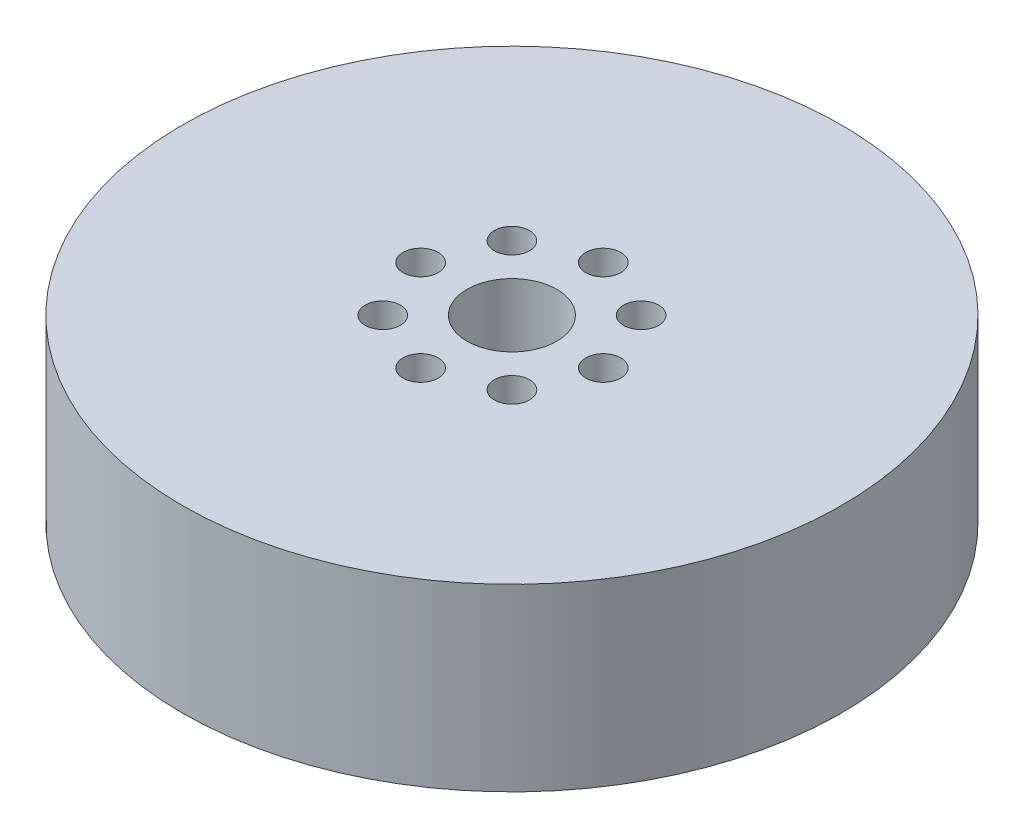
ISO-10303-21;
HEADER;
FILE_DESCRIPTION(('STEP AP214'),'2;1');
FILE_NAME('part.step','',(''),(''),'','','');
FILE_SCHEMA(('AUTOMOTIVE_DESIGN { 1 0 10303 214 1 1 1 1 }'));
ENDSEC;
DATA;
#1=APPLICATION_CONTEXT('core data for automotive mechanical design processes');
#2=APPLICATION_PROTOCOL_DEFINITION('international standard','automotive_design',2000,#1);
#3=PRODUCT_CONTEXT('',#1,'mechanical');
#4=PRODUCT('Part','Part','',(#3));
#5=PRODUCT_RELATED_PRODUCT_CATEGORY('part','',(#4));
#6=PRODUCT_DEFINITION_FORMATION('','',#4);
#7=PRODUCT_DEFINITION_CONTEXT('part definition',#1,'design');
#8=PRODUCT_DEFINITION('design','',#6,#7);
#9=PRODUCT_DEFINITION_SHAPE('','',#8);
#10=(LENGTH_UNIT() NAMED_UNIT(*) SI_UNIT(.MILLI.,.METRE.));
#11=(NAMED_UNIT(*) PLANE_ANGLE_UNIT() SI_UNIT($,.RADIAN.));
#12=(NAMED_UNIT(*) SI_UNIT($,.STERADIAN.) SOLID_ANGLE_UNIT());
#13=UNCERTAINTY_MEASURE_WITH_UNIT(LENGTH_MEASURE(1.E-05),#10,'distance_accuracy_value','');
#14=(GEOMETRIC_REPRESENTATION_CONTEXT(3) GLOBAL_UNCERTAINTY_ASSIGNED_CONTEXT((#13)) GLOBAL_UNIT_ASSIGNED_CONTEXT((#10,
#11,#12)) REPRESENTATION_CONTEXT('',''));
#15=CARTESIAN_POINT('',(0.,0.,0.));
#16=DIRECTION('',(0.,0.,1.));
#17=DIRECTION('',(1.,0.,0.));
#18=AXIS2_PLACEMENT_3D('',#15,#16,#17);
#19=CARTESIAN_POINT('',(0.,30.,0.));
#20=DIRECTION('',(0.,-1.,0.));
#21=DIRECTION('',(0.,0.,-1.));
#22=AXIS2_PLACEMENT_3D('',#19,#20,#21);
#23=CYLINDRICAL_SURFACE('',#22,55.);
#24=CARTESIAN_POINT('',(0.,30.,0.));
#25=DIRECTION('',(0.,1.,0.));
#26=DIRECTION('',(0.,0.,1.));
#27=AXIS2_PLACEMENT_3D('',#24,#25,#26);
#28=CIRCLE('',#27,55.);
#29=CARTESIAN_POINT('',(0.,30.,55.));
#30=VERTEX_POINT('',#29);
#31=EDGE_CURVE('E10',#30,#30,#28,.T.);
#32=ORIENTED_EDGE('',*,*,#31,.F.);
#33=EDGE_LOOP('',(#32));
#34=FACE_BOUND('',#33,.T.);
#35=CARTESIAN_POINT('',(0.,0.,0.));
#36=DIRECTION('',(0.,1.,0.));
#37=DIRECTION('',(0.,0.,1.));
#38=AXIS2_PLACEMENT_3D('',#35,#36,#37);
#39=CIRCLE('',#38,55.);
#40=CARTESIAN_POINT('',(0.,0.,55.));
#41=VERTEX_POINT('',#40);
#42=EDGE_CURVE('E37',#41,#41,#39,.T.);
#43=ORIENTED_EDGE('',*,*,#42,.T.);
#44=EDGE_LOOP('',(#43));
#45=FACE_BOUND('',#44,.T.);
#46=ADVANCED_FACE('F40',(#34,#45),#23,.T.);
#47=CARTESIAN_POINT('',(0.,30.,0.));
#48=DIRECTION('',(0.,1.,0.));
#49=DIRECTION('',(0.,0.,1.));
#50=AXIS2_PLACEMENT_3D('',#47,#48,#49);
#51=PLANE('',#50);
#52=CARTESIAN_POINT('',(0.,30.,15.2427729145403));
#53=DIRECTION('',(0.,1.,0.));
#54=DIRECTION('',(1.,0.,0.));
#55=AXIS2_PLACEMENT_3D('',#52,#53,#54);
#56=CIRCLE('',#55,2.93393942000466);
#57=CARTESIAN_POINT('',(2.93393942000472,30.,15.2427729145403));
#58=VERTEX_POINT('',#57);
#59=EDGE_CURVE('E88',#58,#58,#56,.T.);
#60=ORIENTED_EDGE('',*,*,#59,.F.);
#61=EDGE_LOOP('',(#60));
#62=FACE_BOUND('',#61,.T.);
#63=CARTESIAN_POINT('',(10.7782680919581,30.,10.778268091958));
#64=DIRECTION('',(0.,1.,0.));
#65=DIRECTION('',(0.707106781186544,0.,-0.707106781186551));
#66=AXIS2_PLACEMENT_3D('',#63,#64,#65);
#67=CIRCLE('',#66,2.93393942000466);
#68=CARTESIAN_POINT('',(12.8528765514339,30.,8.70365963248218));
#69=VERTEX_POINT('',#68);
#70=EDGE_CURVE('E79',#69,#69,#67,.T.);
#71=ORIENTED_EDGE('',*,*,#70,.F.);
#72=EDGE_LOOP('',(#71));
#73=FACE_BOUND('',#72,.T.);
#74=CARTESIAN_POINT('',(15.2427729145403,30.,0.));
#75=DIRECTION('',(0.,1.,0.));
#76=DIRECTION('',(0.,0.,-1.));
#77=AXIS2_PLACEMENT_3D('',#74,#75,#76);
#78=CIRCLE('',#77,2.93393942000466);
#79=CARTESIAN_POINT('',(15.2427729145403,30.,-2.93393942000466));
#80=VERTEX_POINT('',#79);
#81=EDGE_CURVE('E74',#80,#80,#78,.T.);
#82=ORIENTED_EDGE('',*,*,#81,.F.);
#83=EDGE_LOOP('',(#82));
#84=FACE_BOUND('',#83,.T.);
#85=CARTESIAN_POINT('',(10.778268091958,30.,-10.7782680919582));
#86=DIRECTION('',(0.,1.,0.));
#87=DIRECTION('',(-0.707106781186554,0.,-0.707106781186541));
#88=AXIS2_PLACEMENT_3D('',#85,#86,#87);
#89=CIRCLE('',#88,2.93393942000466);
#90=CARTESIAN_POINT('',(8.70365963248214,30.,-12.852876551434));
#91=VERTEX_POINT('',#90);
#92=EDGE_CURVE('E70',#91,#91,#89,.T.);
#93=ORIENTED_EDGE('',*,*,#92,.F.);
#94=EDGE_LOOP('',(#93));
#95=FACE_BOUND('',#94,.T.);
#96=CARTESIAN_POINT('',(-1.59659571550023E-13,30.,-15.2427729145403));
#97=DIRECTION('',(0.,1.,0.));
#98=DIRECTION('',(-1.,0.,0.));
#99=AXIS2_PLACEMENT_3D('',#96,#97,#98);
#100=CIRCLE('',#99,2.93393942000466);
#101=CARTESIAN_POINT('',(-2.93393942000482,30.,-15.2427729145403));
#102=VERTEX_POINT('',#101);
#103=EDGE_CURVE('E100',#102,#102,#100,.T.);
#104=ORIENTED_EDGE('',*,*,#103,.F.);
#105=EDGE_LOOP('',(#104));
#106=FACE_BOUND('',#105,.T.);
#107=CARTESIAN_POINT('',(-10.7782680919582,30.,-10.7782680919579));
#108=DIRECTION('',(0.,1.,0.));
#109=DIRECTION('',(-0.707106781186539,0.,0.707106781186556));
#110=AXIS2_PLACEMENT_3D('',#107,#108,#109);
#111=CIRCLE('',#110,2.93393942000466);
#112=CARTESIAN_POINT('',(-12.852876551434,30.,-8.70365963248209));
#113=VERTEX_POINT('',#112);
#114=EDGE_CURVE('E93',#113,#113,#111,.T.);
#115=ORIENTED_EDGE('',*,*,#114,.F.);
#116=EDGE_LOOP('',(#115));
#117=FACE_BOUND('',#116,.T.);
#118=CARTESIAN_POINT('',(-10.7782680919581,30.,10.7782680919581));
#119=DIRECTION('',(0.,1.,0.));
#120=DIRECTION('',(0.707106781186549,0.,0.707106781186546));
#121=AXIS2_PLACEMENT_3D('',#118,#119,#120);
#122=CIRCLE('',#121,2.93393942000466);
#123=CARTESIAN_POINT('',(-8.70365963248223,30.,12.8528765514339));
#124=VERTEX_POINT('',#123);
#125=EDGE_CURVE('E61',#124,#124,#122,.T.);
#126=ORIENTED_EDGE('',*,*,#125,.F.);
#127=EDGE_LOOP('',(#126));
#128=FACE_BOUND('',#127,.T.);
#129=CARTESIAN_POINT('',(-15.2427729145403,30.,0.));
#130=DIRECTION('',(0.,1.,0.));
#131=DIRECTION('',(0.,0.,1.));
#132=AXIS2_PLACEMENT_3D('',#129,#130,#131);
#133=CIRCLE('',#132,2.93393942000466);
#134=CARTESIAN_POINT('',(-15.2427729145403,30.,2.93393942000466));
#135=VERTEX_POINT('',#134);
#136=EDGE_CURVE('E54',#135,#135,#133,.T.);
#137=ORIENTED_EDGE('',*,*,#136,.F.);
#138=EDGE_LOOP('',(#137));
#139=FACE_BOUND('',#138,.T.);
#140=CARTESIAN_POINT('',(0.,30.,0.));
#141=DIRECTION('',(0.,1.,0.));
#142=DIRECTION('',(0.,0.,1.));
#143=AXIS2_PLACEMENT_3D('',#140,#141,#142);
#144=CIRCLE('',#143,7.5);
#145=CARTESIAN_POINT('',(0.,30.,7.5));
#146=VERTEX_POINT('',#145);
#147=EDGE_CURVE('E50',#146,#146,#144,.T.);
#148=ORIENTED_EDGE('',*,*,#147,.F.);
#149=EDGE_LOOP('',(#148));
#150=FACE_BOUND('',#149,.T.);
#151=ORIENTED_EDGE('',*,*,#31,.T.);
#152=EDGE_LOOP('',(#151));
#153=FACE_BOUND('',#152,.T.);
#154=ADVANCED_FACE('F115',(#62,#73,#84,#95,#106,#117,#128,#139,#150,#153),#51,.T.);
#155=CARTESIAN_POINT('',(0.,0.,0.));
#156=DIRECTION('',(0.,1.,0.));
#157=DIRECTION('',(0.,0.,1.));
#158=AXIS2_PLACEMENT_3D('',#155,#156,#157);
#159=PLANE('',#158);
#160=CARTESIAN_POINT('',(0.,0.,0.));
#161=DIRECTION('',(0.,1.,0.));
#162=DIRECTION('',(0.,0.,1.));
#163=AXIS2_PLACEMENT_3D('',#160,#161,#162);
#164=CIRCLE('',#163,7.5);
#165=CARTESIAN_POINT('',(0.,0.,7.5));
#166=VERTEX_POINT('',#165);
#167=EDGE_CURVE('E47',#166,#166,#164,.T.);
#168=ORIENTED_EDGE('',*,*,#167,.T.);
#169=EDGE_LOOP('',(#168));
#170=FACE_BOUND('',#169,.T.);
#171=ORIENTED_EDGE('',*,*,#42,.F.);
#172=EDGE_LOOP('',(#171));
#173=FACE_BOUND('',#172,.T.);
#174=ADVANCED_FACE('F113',(#170,#173),#159,.F.);
#175=CARTESIAN_POINT('',(0.,30.,0.));
#176=DIRECTION('',(0.,-1.,0.));
#177=DIRECTION('',(0.,0.,-1.));
#178=AXIS2_PLACEMENT_3D('',#175,#176,#177);
#179=CYLINDRICAL_SURFACE('',#178,7.5);
#180=ORIENTED_EDGE('',*,*,#147,.T.);
#181=EDGE_LOOP('',(#180));
#182=FACE_BOUND('',#181,.T.);
#183=ORIENTED_EDGE('',*,*,#167,.F.);
#184=EDGE_LOOP('',(#183));
#185=FACE_BOUND('',#184,.T.);
#186=ADVANCED_FACE('F127',(#182,#185),#179,.F.);
#187=CARTESIAN_POINT('',(-15.2427729145403,6.60301813890324,0.));
#188=DIRECTION('',(0.,1.,0.));
#189=DIRECTION('',(0.,0.,1.));
#190=AXIS2_PLACEMENT_3D('',#187,#188,#189);
#191=CYLINDRICAL_SURFACE('',#190,2.93393942000466);
#192=CARTESIAN_POINT('',(-15.2427729145403,6.60301813890324,0.));
#193=DIRECTION('',(0.,1.,0.));
#194=DIRECTION('',(0.,0.,1.));
#195=AXIS2_PLACEMENT_3D('',#192,#193,#194);
#196=CIRCLE('',#195,2.93393942000466);
#197=CARTESIAN_POINT('',(-15.2427729145403,6.60301813890324,2.93393942000466));
#198=VERTEX_POINT('',#197);
#199=EDGE_CURVE('E55',#198,#198,#196,.T.);
#200=ORIENTED_EDGE('',*,*,#199,.F.);
#201=EDGE_LOOP('',(#200));
#202=FACE_BOUND('',#201,.T.);
#203=ORIENTED_EDGE('',*,*,#136,.T.);
#204=EDGE_LOOP('',(#203));
#205=FACE_BOUND('',#204,.T.);
#206=ADVANCED_FACE('F129',(#202,#205),#191,.F.);
#207=CARTESIAN_POINT('',(-15.2427729145403,6.60301813890324,0.));
#208=DIRECTION('',(0.,1.,0.));
#209=DIRECTION('',(0.,0.,1.));
#210=AXIS2_PLACEMENT_3D('',#207,#208,#209);
#211=PLANE('',#210);
#212=ORIENTED_EDGE('',*,*,#199,.T.);
#213=EDGE_LOOP('',(#212));
#214=FACE_BOUND('',#213,.T.);
#215=ADVANCED_FACE('F157',(#214),#211,.T.);
#216=CARTESIAN_POINT('',(-10.7782680919581,6.60301813890324,10.7782680919581));
#217=DIRECTION('',(0.,1.,0.));
#218=DIRECTION('',(0.,0.,1.));
#219=AXIS2_PLACEMENT_3D('',#216,#217,#218);
#220=CYLINDRICAL_SURFACE('',#219,2.93393942000466);
#221=CARTESIAN_POINT('',(-10.7782680919581,6.60301813890324,10.7782680919581));
#222=DIRECTION('',(0.,1.,0.));
#223=DIRECTION('',(0.707106781186549,0.,0.707106781186546));
#224=AXIS2_PLACEMENT_3D('',#221,#222,#223);
#225=CIRCLE('',#224,2.93393942000466);
#226=CARTESIAN_POINT('',(-8.70365963248223,6.60301813890324,12.8528765514339));
#227=VERTEX_POINT('',#226);
#228=EDGE_CURVE('E59',#227,#227,#225,.T.);
#229=ORIENTED_EDGE('',*,*,#228,.F.);
#230=EDGE_LOOP('',(#229));
#231=FACE_BOUND('',#230,.T.);
#232=ORIENTED_EDGE('',*,*,#125,.T.);
#233=EDGE_LOOP('',(#232));
#234=FACE_BOUND('',#233,.T.);
#235=ADVANCED_FACE('F170',(#231,#234),#220,.F.);
#236=CARTESIAN_POINT('',(-10.7782680919581,6.60301813890324,10.7782680919581));
#237=DIRECTION('',(0.,1.,0.));
#238=DIRECTION('',(0.707106781186549,0.,0.707106781186546));
#239=AXIS2_PLACEMENT_3D('',#236,#237,#238);
#240=PLANE('',#239);
#241=ORIENTED_EDGE('',*,*,#228,.T.);
#242=EDGE_LOOP('',(#241));
#243=FACE_BOUND('',#242,.T.);
#244=ADVANCED_FACE('F182',(#243),#240,.T.);
#245=CARTESIAN_POINT('',(-10.7782680919582,6.60301813890324,-10.7782680919579));
#246=DIRECTION('',(0.,1.,0.));
#247=DIRECTION('',(0.,0.,1.));
#248=AXIS2_PLACEMENT_3D('',#245,#246,#247);
#249=CYLINDRICAL_SURFACE('',#248,2.93393942000466);
#250=CARTESIAN_POINT('',(-10.7782680919582,6.60301813890324,-10.7782680919579));
#251=DIRECTION('',(0.,1.,0.));
#252=DIRECTION('',(-0.707106781186539,0.,0.707106781186556));
#253=AXIS2_PLACEMENT_3D('',#250,#251,#252);
#254=CIRCLE('',#253,2.93393942000466);
#255=CARTESIAN_POINT('',(-12.852876551434,6.60301813890324,-8.70365963248209));
#256=VERTEX_POINT('',#255);
#257=EDGE_CURVE('E94',#256,#256,#254,.T.);
#258=ORIENTED_EDGE('',*,*,#257,.F.);
#259=EDGE_LOOP('',(#258));
#260=FACE_BOUND('',#259,.T.);
#261=ORIENTED_EDGE('',*,*,#114,.T.);
#262=EDGE_LOOP('',(#261));
#263=FACE_BOUND('',#262,.T.);
#264=ADVANCED_FACE('F189',(#260,#263),#249,.F.);
#265=CARTESIAN_POINT('',(-10.7782680919582,6.60301813890324,-10.7782680919579));
#266=DIRECTION('',(0.,1.,0.));
#267=DIRECTION('',(-0.707106781186539,0.,0.707106781186556));
#268=AXIS2_PLACEMENT_3D('',#265,#266,#267);
#269=PLANE('',#268);
#270=ORIENTED_EDGE('',*,*,#257,.T.);
#271=EDGE_LOOP('',(#270));
#272=FACE_BOUND('',#271,.T.);
#273=ADVANCED_FACE('F107',(#272),#269,.T.);
#274=CARTESIAN_POINT('',(-1.59659571550023E-13,6.60301813890324,-15.2427729145403));
#275=DIRECTION('',(0.,1.,0.));
#276=DIRECTION('',(0.,0.,1.));
#277=AXIS2_PLACEMENT_3D('',#274,#275,#276);
#278=CYLINDRICAL_SURFACE('',#277,2.93393942000466);
#279=CARTESIAN_POINT('',(-1.59659571550023E-13,6.60301813890324,-15.2427729145403));
#280=DIRECTION('',(0.,1.,0.));
#281=DIRECTION('',(-1.,0.,0.));
#282=AXIS2_PLACEMENT_3D('',#279,#280,#281);
#283=CIRCLE('',#282,2.93393942000466);
#284=CARTESIAN_POINT('',(-2.93393942000482,6.60301813890324,-15.2427729145403));
#285=VERTEX_POINT('',#284);
#286=EDGE_CURVE('E72',#285,#285,#283,.T.);
#287=ORIENTED_EDGE('',*,*,#286,.F.);
#288=EDGE_LOOP('',(#287));
#289=FACE_BOUND('',#288,.T.);
#290=ORIENTED_EDGE('',*,*,#103,.T.);
#291=EDGE_LOOP('',(#290));
#292=FACE_BOUND('',#291,.T.);
#293=ADVANCED_FACE('F104',(#289,#292),#278,.F.);
#294=CARTESIAN_POINT('',(-1.59659571550023E-13,6.60301813890324,-15.2427729145403));
#295=DIRECTION('',(0.,1.,0.));
#296=DIRECTION('',(-1.,0.,0.));
#297=AXIS2_PLACEMENT_3D('',#294,#295,#296);
#298=PLANE('',#297);
#299=ORIENTED_EDGE('',*,*,#286,.T.);
#300=EDGE_LOOP('',(#299));
#301=FACE_BOUND('',#300,.T.);
#302=ADVANCED_FACE('F103',(#301),#298,.T.);
#303=CARTESIAN_POINT('',(10.778268091958,6.60301813890324,-10.7782680919582));
#304=DIRECTION('',(0.,1.,0.));
#305=DIRECTION('',(0.,0.,1.));
#306=AXIS2_PLACEMENT_3D('',#303,#304,#305);
#307=CYLINDRICAL_SURFACE('',#306,2.93393942000466);
#308=CARTESIAN_POINT('',(10.778268091958,6.60301813890324,-10.7782680919582));
#309=DIRECTION('',(0.,1.,0.));
#310=DIRECTION('',(-0.707106781186554,0.,-0.707106781186541));
#311=AXIS2_PLACEMENT_3D('',#308,#309,#310);
#312=CIRCLE('',#311,2.93393942000466);
#313=CARTESIAN_POINT('',(8.70365963248214,6.60301813890324,-12.852876551434));
#314=VERTEX_POINT('',#313);
#315=EDGE_CURVE('E69',#314,#314,#312,.T.);
#316=ORIENTED_EDGE('',*,*,#315,.F.);
#317=EDGE_LOOP('',(#316));
#318=FACE_BOUND('',#317,.T.);
#319=ORIENTED_EDGE('',*,*,#92,.T.);
#320=EDGE_LOOP('',(#319));
#321=FACE_BOUND('',#320,.T.);
#322=ADVANCED_FACE('F219',(#318,#321),#307,.F.);
#323=CARTESIAN_POINT('',(10.778268091958,6.60301813890324,-10.7782680919582));
#324=DIRECTION('',(0.,1.,0.));
#325=DIRECTION('',(-0.707106781186554,0.,-0.707106781186541));
#326=AXIS2_PLACEMENT_3D('',#323,#324,#325);
#327=PLANE('',#326);
#328=ORIENTED_EDGE('',*,*,#315,.T.);
#329=EDGE_LOOP('',(#328));
#330=FACE_BOUND('',#329,.T.);
#331=ADVANCED_FACE('F227',(#330),#327,.T.);
#332=CARTESIAN_POINT('',(15.2427729145403,6.60301813890324,0.));
#333=DIRECTION('',(0.,1.,0.));
#334=DIRECTION('',(0.,0.,1.));
#335=AXIS2_PLACEMENT_3D('',#332,#333,#334);
#336=CYLINDRICAL_SURFACE('',#335,2.93393942000466);
#337=CARTESIAN_POINT('',(15.2427729145403,6.60301813890324,0.));
#338=DIRECTION('',(0.,1.,0.));
#339=DIRECTION('',(0.,0.,-1.));
#340=AXIS2_PLACEMENT_3D('',#337,#338,#339);
#341=CIRCLE('',#340,2.93393942000466);
#342=CARTESIAN_POINT('',(15.2427729145403,6.60301813890324,-2.93393942000466));
#343=VERTEX_POINT('',#342);
#344=EDGE_CURVE('E80',#343,#343,#341,.T.);
#345=ORIENTED_EDGE('',*,*,#344,.F.);
#346=EDGE_LOOP('',(#345));
#347=FACE_BOUND('',#346,.T.);
#348=ORIENTED_EDGE('',*,*,#81,.T.);
#349=EDGE_LOOP('',(#348));
#350=FACE_BOUND('',#349,.T.);
#351=ADVANCED_FACE('F240',(#347,#350),#336,.F.);
#352=CARTESIAN_POINT('',(15.2427729145403,6.60301813890324,0.));
#353=DIRECTION('',(0.,1.,0.));
#354=DIRECTION('',(0.,0.,-1.));
#355=AXIS2_PLACEMENT_3D('',#352,#353,#354);
#356=PLANE('',#355);
#357=ORIENTED_EDGE('',*,*,#344,.T.);
#358=EDGE_LOOP('',(#357));
#359=FACE_BOUND('',#358,.T.);
#360=ADVANCED_FACE('F246',(#359),#356,.T.);
#361=CARTESIAN_POINT('',(10.7782680919581,6.60301813890324,10.778268091958));
#362=DIRECTION('',(0.,1.,0.));
#363=DIRECTION('',(0.,0.,1.));
#364=AXIS2_PLACEMENT_3D('',#361,#362,#363);
#365=CYLINDRICAL_SURFACE('',#364,2.93393942000466);
#366=CARTESIAN_POINT('',(10.7782680919581,6.60301813890324,10.778268091958));
#367=DIRECTION('',(0.,1.,0.));
#368=DIRECTION('',(0.707106781186544,0.,-0.707106781186551));
#369=AXIS2_PLACEMENT_3D('',#366,#367,#368);
#370=CIRCLE('',#369,2.93393942000466);
#371=CARTESIAN_POINT('',(12.8528765514339,6.60301813890324,8.70365963248218));
#372=VERTEX_POINT('',#371);
#373=EDGE_CURVE('E82',#372,#372,#370,.T.);
#374=ORIENTED_EDGE('',*,*,#373,.F.);
#375=EDGE_LOOP('',(#374));
#376=FACE_BOUND('',#375,.T.);
#377=ORIENTED_EDGE('',*,*,#70,.T.);
#378=EDGE_LOOP('',(#377));
#379=FACE_BOUND('',#378,.T.);
#380=ADVANCED_FACE('F254',(#376,#379),#365,.F.);
#381=CARTESIAN_POINT('',(10.7782680919581,6.60301813890324,10.778268091958));
#382=DIRECTION('',(0.,1.,0.));
#383=DIRECTION('',(0.707106781186544,0.,-0.707106781186551));
#384=AXIS2_PLACEMENT_3D('',#381,#382,#383);
#385=PLANE('',#384);
#386=ORIENTED_EDGE('',*,*,#373,.T.);
#387=EDGE_LOOP('',(#386));
#388=FACE_BOUND('',#387,.T.);
#389=ADVANCED_FACE('F262',(#388),#385,.T.);
#390=CARTESIAN_POINT('',(0.,6.60301813890324,15.2427729145403));
#391=DIRECTION('',(0.,1.,0.));
#392=DIRECTION('',(0.,0.,1.));
#393=AXIS2_PLACEMENT_3D('',#390,#391,#392);
#394=CYLINDRICAL_SURFACE('',#393,2.93393942000466);
#395=CARTESIAN_POINT('',(0.,6.60301813890324,15.2427729145403));
#396=DIRECTION('',(0.,1.,0.));
#397=DIRECTION('',(1.,0.,0.));
#398=AXIS2_PLACEMENT_3D('',#395,#396,#397);
#399=CIRCLE('',#398,2.93393942000466);
#400=CARTESIAN_POINT('',(2.93393942000472,6.60301813890324,15.2427729145403));
#401=VERTEX_POINT('',#400);
#402=EDGE_CURVE('E63',#401,#401,#399,.T.);
#403=ORIENTED_EDGE('',*,*,#402,.F.);
#404=EDGE_LOOP('',(#403));
#405=FACE_BOUND('',#404,.T.);
#406=ORIENTED_EDGE('',*,*,#59,.T.);
#407=EDGE_LOOP('',(#406));
#408=FACE_BOUND('',#407,.T.);
#409=ADVANCED_FACE('F272',(#405,#408),#394,.F.);
#410=CARTESIAN_POINT('',(0.,6.60301813890324,15.2427729145403));
#411=DIRECTION('',(0.,1.,0.));
#412=DIRECTION('',(1.,0.,0.));
#413=AXIS2_PLACEMENT_3D('',#410,#411,#412);
#414=PLANE('',#413);
#415=ORIENTED_EDGE('',*,*,#402,.T.);
#416=EDGE_LOOP('',(#415));
#417=FACE_BOUND('',#416,.T.);
#418=ADVANCED_FACE('F285',(#417),#414,.T.);
#419=CLOSED_SHELL('',(#46,#154,#174,#186,#206,#215,#235,#244,#264,#273,#293,#302,#322,#331,#351,
#360,#380,#389,#409,#418));
#420=MANIFOLD_SOLID_BREP('B2',#419);
#421=ADVANCED_BREP_SHAPE_REPRESENTATION('',(#18,#420),#14);
#422=SHAPE_DEFINITION_REPRESENTATION(#9,#421);
ENDSEC;
END-ISO-10303-21;
